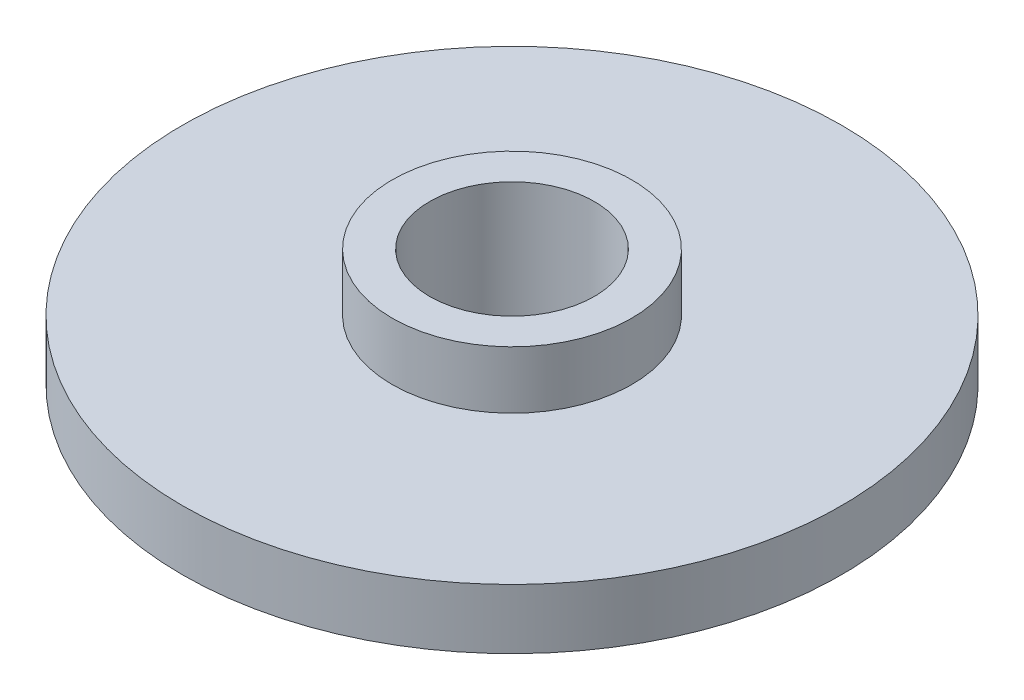
ISO-10303-21;
HEADER;
FILE_DESCRIPTION(('STEP AP214'),'2;1');
FILE_NAME('part.step','',(''),(''),'','','');
FILE_SCHEMA(('AUTOMOTIVE_DESIGN { 1 0 10303 214 1 1 1 1 }'));
ENDSEC;
DATA;
#1=APPLICATION_CONTEXT('core data for automotive mechanical design processes');
#2=APPLICATION_PROTOCOL_DEFINITION('international standard','automotive_design',2000,#1);
#3=PRODUCT_CONTEXT('',#1,'mechanical');
#4=PRODUCT('Part','Part','',(#3));
#5=PRODUCT_RELATED_PRODUCT_CATEGORY('part','',(#4));
#6=PRODUCT_DEFINITION_FORMATION('','',#4);
#7=PRODUCT_DEFINITION_CONTEXT('part definition',#1,'design');
#8=PRODUCT_DEFINITION('design','',#6,#7);
#9=PRODUCT_DEFINITION_SHAPE('','',#8);
#10=(LENGTH_UNIT() NAMED_UNIT(*) SI_UNIT(.MILLI.,.METRE.));
#11=(NAMED_UNIT(*) PLANE_ANGLE_UNIT() SI_UNIT($,.RADIAN.));
#12=(NAMED_UNIT(*) SI_UNIT($,.STERADIAN.) SOLID_ANGLE_UNIT());
#13=UNCERTAINTY_MEASURE_WITH_UNIT(LENGTH_MEASURE(1.E-05),#10,'distance_accuracy_value','');
#14=(GEOMETRIC_REPRESENTATION_CONTEXT(3) GLOBAL_UNCERTAINTY_ASSIGNED_CONTEXT((#13)) GLOBAL_UNIT_ASSIGNED_CONTEXT((#10,
#11,#12)) REPRESENTATION_CONTEXT('',''));
#15=CARTESIAN_POINT('',(0.,0.,0.));
#16=DIRECTION('',(0.,0.,1.));
#17=DIRECTION('',(1.,0.,0.));
#18=AXIS2_PLACEMENT_3D('',#15,#16,#17);
#19=CARTESIAN_POINT('',(0.,1.,0.));
#20=DIRECTION('',(0.,-1.,0.));
#21=DIRECTION('',(0.,0.,-1.));
#22=AXIS2_PLACEMENT_3D('',#19,#20,#21);
#23=CYLINDRICAL_SURFACE('',#22,5.5);
#24=CARTESIAN_POINT('',(0.,1.,0.));
#25=DIRECTION('',(0.,1.,0.));
#26=DIRECTION('',(0.,0.,1.));
#27=AXIS2_PLACEMENT_3D('',#24,#25,#26);
#28=CIRCLE('',#27,5.5);
#29=CARTESIAN_POINT('',(0.,1.,5.5));
#30=VERTEX_POINT('',#29);
#31=EDGE_CURVE('E50',#30,#30,#28,.T.);
#32=ORIENTED_EDGE('',*,*,#31,.F.);
#33=EDGE_LOOP('',(#32));
#34=FACE_BOUND('',#33,.T.);
#35=CARTESIAN_POINT('',(0.,0.,0.));
#36=DIRECTION('',(0.,1.,0.));
#37=DIRECTION('',(0.,0.,1.));
#38=AXIS2_PLACEMENT_3D('',#35,#36,#37);
#39=CIRCLE('',#38,5.5);
#40=CARTESIAN_POINT('',(0.,0.,5.5));
#41=VERTEX_POINT('',#40);
#42=EDGE_CURVE('E45',#41,#41,#39,.T.);
#43=ORIENTED_EDGE('',*,*,#42,.T.);
#44=EDGE_LOOP('',(#43));
#45=FACE_BOUND('',#44,.T.);
#46=ADVANCED_FACE('F42',(#34,#45),#23,.T.);
#47=CARTESIAN_POINT('',(0.,1.,0.));
#48=DIRECTION('',(0.,1.,0.));
#49=DIRECTION('',(0.,0.,1.));
#50=AXIS2_PLACEMENT_3D('',#47,#48,#49);
#51=PLANE('',#50);
#52=CARTESIAN_POINT('',(0.,1.,0.));
#53=DIRECTION('',(0.,1.,0.));
#54=DIRECTION('',(0.,0.,1.));
#55=AXIS2_PLACEMENT_3D('',#52,#53,#54);
#56=CIRCLE('',#55,2.);
#57=CARTESIAN_POINT('',(0.,1.,2.));
#58=VERTEX_POINT('',#57);
#59=EDGE_CURVE('E10',#58,#58,#56,.T.);
#60=ORIENTED_EDGE('',*,*,#59,.F.);
#61=EDGE_LOOP('',(#60));
#62=FACE_BOUND('',#61,.T.);
#63=ORIENTED_EDGE('',*,*,#31,.T.);
#64=EDGE_LOOP('',(#63));
#65=FACE_BOUND('',#64,.T.);
#66=ADVANCED_FACE('F87',(#62,#65),#51,.T.);
#67=CARTESIAN_POINT('',(0.,0.,0.));
#68=DIRECTION('',(0.,1.,0.));
#69=DIRECTION('',(0.,0.,1.));
#70=AXIS2_PLACEMENT_3D('',#67,#68,#69);
#71=PLANE('',#70);
#72=CARTESIAN_POINT('',(0.,0.,0.));
#73=DIRECTION('',(0.,1.,0.));
#74=DIRECTION('',(0.,0.,1.));
#75=AXIS2_PLACEMENT_3D('',#72,#73,#74);
#76=CIRCLE('',#75,1.37425527700072);
#77=CARTESIAN_POINT('',(0.,0.,1.37425527700072));
#78=VERTEX_POINT('',#77);
#79=EDGE_CURVE('E61',#78,#78,#76,.T.);
#80=ORIENTED_EDGE('',*,*,#79,.T.);
#81=EDGE_LOOP('',(#80));
#82=FACE_BOUND('',#81,.T.);
#83=ORIENTED_EDGE('',*,*,#42,.F.);
#84=EDGE_LOOP('',(#83));
#85=FACE_BOUND('',#84,.T.);
#86=ADVANCED_FACE('F81',(#82,#85),#71,.F.);
#87=CARTESIAN_POINT('',(0.,1.96,0.));
#88=DIRECTION('',(0.,-1.,0.));
#89=DIRECTION('',(0.,0.,-1.));
#90=AXIS2_PLACEMENT_3D('',#87,#88,#89);
#91=CYLINDRICAL_SURFACE('',#90,2.);
#92=CARTESIAN_POINT('',(0.,1.96,0.));
#93=DIRECTION('',(0.,1.,0.));
#94=DIRECTION('',(0.,0.,1.));
#95=AXIS2_PLACEMENT_3D('',#92,#93,#94);
#96=CIRCLE('',#95,2.);
#97=CARTESIAN_POINT('',(0.,1.96,2.));
#98=VERTEX_POINT('',#97);
#99=EDGE_CURVE('E57',#98,#98,#96,.T.);
#100=ORIENTED_EDGE('',*,*,#99,.F.);
#101=EDGE_LOOP('',(#100));
#102=FACE_BOUND('',#101,.T.);
#103=ORIENTED_EDGE('',*,*,#59,.T.);
#104=EDGE_LOOP('',(#103));
#105=FACE_BOUND('',#104,.T.);
#106=ADVANCED_FACE('F76',(#102,#105),#91,.T.);
#107=CARTESIAN_POINT('',(0.,1.96,0.));
#108=DIRECTION('',(0.,1.,0.));
#109=DIRECTION('',(0.,0.,1.));
#110=AXIS2_PLACEMENT_3D('',#107,#108,#109);
#111=PLANE('',#110);
#112=CARTESIAN_POINT('',(0.,1.96,0.));
#113=DIRECTION('',(0.,1.,0.));
#114=DIRECTION('',(0.,0.,1.));
#115=AXIS2_PLACEMENT_3D('',#112,#113,#114);
#116=CIRCLE('',#115,1.37425527700072);
#117=CARTESIAN_POINT('',(0.,1.96,1.37425527700072));
#118=VERTEX_POINT('',#117);
#119=EDGE_CURVE('E65',#118,#118,#116,.T.);
#120=ORIENTED_EDGE('',*,*,#119,.F.);
#121=EDGE_LOOP('',(#120));
#122=FACE_BOUND('',#121,.T.);
#123=ORIENTED_EDGE('',*,*,#99,.T.);
#124=EDGE_LOOP('',(#123));
#125=FACE_BOUND('',#124,.T.);
#126=ADVANCED_FACE('F73',(#122,#125),#111,.T.);
#127=CARTESIAN_POINT('',(0.,-5.,0.));
#128=DIRECTION('',(0.,1.,0.));
#129=DIRECTION('',(0.,0.,1.));
#130=AXIS2_PLACEMENT_3D('',#127,#128,#129);
#131=CYLINDRICAL_SURFACE('',#130,1.37425527700072);
#132=ORIENTED_EDGE('',*,*,#119,.T.);
#133=EDGE_LOOP('',(#132));
#134=FACE_BOUND('',#133,.T.);
#135=ORIENTED_EDGE('',*,*,#79,.F.);
#136=EDGE_LOOP('',(#135));
#137=FACE_BOUND('',#136,.T.);
#138=ADVANCED_FACE('F70',(#134,#137),#131,.F.);
#139=CLOSED_SHELL('',(#46,#66,#86,#106,#126,#138));
#140=MANIFOLD_SOLID_BREP('B2',#139);
#141=ADVANCED_BREP_SHAPE_REPRESENTATION('',(#18,#140),#14);
#142=SHAPE_DEFINITION_REPRESENTATION(#9,#141);
ENDSEC;
END-ISO-10303-21;
